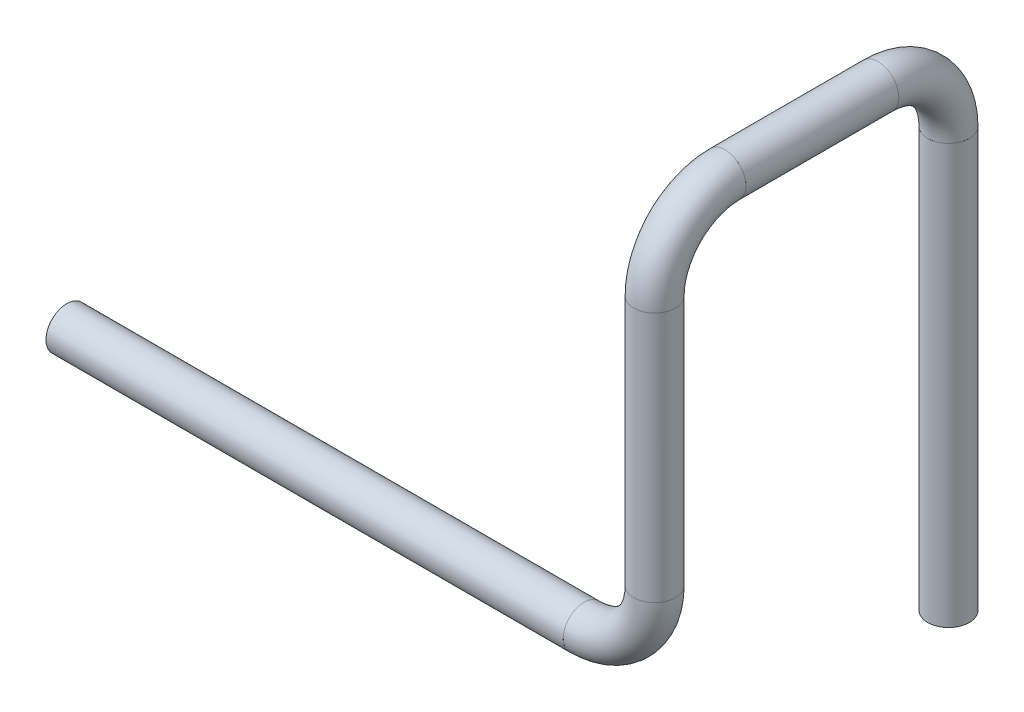
ISO-10303-21;
HEADER;
FILE_DESCRIPTION(('STEP AP214'),'2;1');
FILE_NAME('part.step','',(''),(''),'','','');
FILE_SCHEMA(('AUTOMOTIVE_DESIGN { 1 0 10303 214 1 1 1 1 }'));
ENDSEC;
DATA;
#1=APPLICATION_CONTEXT('core data for automotive mechanical design processes');
#2=APPLICATION_PROTOCOL_DEFINITION('international standard','automotive_design',2000,#1);
#3=PRODUCT_CONTEXT('',#1,'mechanical');
#4=PRODUCT('Part','Part','',(#3));
#5=PRODUCT_RELATED_PRODUCT_CATEGORY('part','',(#4));
#6=PRODUCT_DEFINITION_FORMATION('','',#4);
#7=PRODUCT_DEFINITION_CONTEXT('part definition',#1,'design');
#8=PRODUCT_DEFINITION('design','',#6,#7);
#9=PRODUCT_DEFINITION_SHAPE('','',#8);
#10=(LENGTH_UNIT() NAMED_UNIT(*) SI_UNIT(.MILLI.,.METRE.));
#11=(NAMED_UNIT(*) PLANE_ANGLE_UNIT() SI_UNIT($,.RADIAN.));
#12=(NAMED_UNIT(*) SI_UNIT($,.STERADIAN.) SOLID_ANGLE_UNIT());
#13=UNCERTAINTY_MEASURE_WITH_UNIT(LENGTH_MEASURE(1.E-05),#10,'distance_accuracy_value','');
#14=(GEOMETRIC_REPRESENTATION_CONTEXT(3) GLOBAL_UNCERTAINTY_ASSIGNED_CONTEXT((#13)) GLOBAL_UNIT_ASSIGNED_CONTEXT((#10,
#11,#12)) REPRESENTATION_CONTEXT('',''));
#15=CARTESIAN_POINT('',(0.,0.,0.));
#16=DIRECTION('',(0.,0.,1.));
#17=DIRECTION('',(1.,0.,0.));
#18=AXIS2_PLACEMENT_3D('',#15,#16,#17);
#19=CARTESIAN_POINT('',(264.,0.,0.));
#20=DIRECTION('',(-1.,0.,0.));
#21=DIRECTION('',(0.,0.,1.));
#22=AXIS2_PLACEMENT_3D('',#19,#20,#21);
#23=CYLINDRICAL_SURFACE('',#22,8.35);
#24=CARTESIAN_POINT('',(0.,0.,0.));
#25=DIRECTION('',(1.,0.,0.));
#26=DIRECTION('',(0.,0.,-1.));
#27=AXIS2_PLACEMENT_3D('',#24,#25,#26);
#28=CIRCLE('',#27,8.35);
#29=CARTESIAN_POINT('',(0.,0.,-8.35));
#30=VERTEX_POINT('',#29);
#31=EDGE_CURVE('E57',#30,#30,#28,.T.);
#32=ORIENTED_EDGE('',*,*,#31,.F.);
#33=EDGE_LOOP('',(#32));
#34=FACE_BOUND('',#33,.T.);
#35=CARTESIAN_POINT('',(264.,0.,0.));
#36=DIRECTION('',(1.,0.,0.));
#37=DIRECTION('',(0.,0.,-1.));
#38=AXIS2_PLACEMENT_3D('',#35,#36,#37);
#39=CIRCLE('',#38,8.35);
#40=CARTESIAN_POINT('',(264.,0.,-8.35));
#41=VERTEX_POINT('',#40);
#42=EDGE_CURVE('E53',#41,#41,#39,.T.);
#43=ORIENTED_EDGE('',*,*,#42,.T.);
#44=EDGE_LOOP('',(#43));
#45=FACE_BOUND('',#44,.T.);
#46=ADVANCED_FACE('F49',(#34,#45),#23,.F.);
#47=CARTESIAN_POINT('',(264.,0.,0.));
#48=DIRECTION('',(-1.,0.,0.));
#49=DIRECTION('',(0.,0.,1.));
#50=AXIS2_PLACEMENT_3D('',#47,#48,#49);
#51=CYLINDRICAL_SURFACE('',#50,10.65);
#52=CARTESIAN_POINT('',(0.,0.,0.));
#53=DIRECTION('',(1.,0.,0.));
#54=DIRECTION('',(0.,0.,-1.));
#55=AXIS2_PLACEMENT_3D('',#52,#53,#54);
#56=CIRCLE('',#55,10.65);
#57=CARTESIAN_POINT('',(0.,0.,-10.65));
#58=VERTEX_POINT('',#57);
#59=EDGE_CURVE('E61',#58,#58,#56,.T.);
#60=ORIENTED_EDGE('',*,*,#59,.T.);
#61=EDGE_LOOP('',(#60));
#62=FACE_BOUND('',#61,.T.);
#63=CARTESIAN_POINT('',(264.,0.,0.));
#64=DIRECTION('',(1.,0.,0.));
#65=DIRECTION('',(0.,0.,-1.));
#66=AXIS2_PLACEMENT_3D('',#63,#64,#65);
#67=CIRCLE('',#66,10.65);
#68=CARTESIAN_POINT('',(264.,0.,-10.65));
#69=VERTEX_POINT('',#68);
#70=EDGE_CURVE('E12',#69,#69,#67,.T.);
#71=ORIENTED_EDGE('',*,*,#70,.F.);
#72=EDGE_LOOP('',(#71));
#73=FACE_BOUND('',#72,.T.);
#74=ADVANCED_FACE('F76',(#62,#73),#51,.T.);
#75=CARTESIAN_POINT('',(0.,0.,0.));
#76=DIRECTION('',(1.,0.,0.));
#77=DIRECTION('',(0.,0.,-1.));
#78=AXIS2_PLACEMENT_3D('',#75,#76,#77);
#79=PLANE('',#78);
#80=ORIENTED_EDGE('',*,*,#31,.T.);
#81=EDGE_LOOP('',(#80));
#82=FACE_BOUND('',#81,.T.);
#83=ORIENTED_EDGE('',*,*,#59,.F.);
#84=EDGE_LOOP('',(#83));
#85=FACE_BOUND('',#84,.T.);
#86=ADVANCED_FACE('F72',(#82,#85),#79,.F.);
#87=CARTESIAN_POINT('',(264.,0.,0.));
#88=DIRECTION('',(1.,0.,0.));
#89=DIRECTION('',(0.,0.,-1.));
#90=AXIS2_PLACEMENT_3D('',#87,#88,#89);
#91=PLANE('',#90);
#92=ORIENTED_EDGE('',*,*,#42,.F.);
#93=EDGE_LOOP('',(#92));
#94=FACE_BOUND('',#93,.T.);
#95=ORIENTED_EDGE('',*,*,#70,.T.);
#96=EDGE_LOOP('',(#95));
#97=FACE_BOUND('',#96,.T.);
#98=ADVANCED_FACE('F51',(#94,#97),#91,.T.);
#99=CLOSED_SHELL('',(#46,#74,#86,#98));
#100=MANIFOLD_SOLID_BREP('B2',#99);
#101=CARTESIAN_POINT('',(264.,36.,0.));
#102=DIRECTION('',(0.,0.,-1.));
#103=DIRECTION('',(-1.,0.,0.));
#104=AXIS2_PLACEMENT_3D('',#101,#102,#103);
#105=TOROIDAL_SURFACE('',#104,35.9999999999999,8.35);
#106=CARTESIAN_POINT('',(300.,36.,0.));
#107=DIRECTION('',(0.,1.,0.));
#108=DIRECTION('',(-1.,0.,0.));
#109=AXIS2_PLACEMENT_3D('',#106,#107,#108);
#110=CIRCLE('',#109,8.35);
#111=CARTESIAN_POINT('',(308.35,36.,0.));
#112=VERTEX_POINT('',#111);
#113=EDGE_CURVE('E153',#112,#112,#110,.T.);
#114=CARTESIAN_POINT('',(264.,0.,0.));
#115=DIRECTION('',(-1.,0.,0.));
#116=DIRECTION('',(0.,0.,1.));
#117=AXIS2_PLACEMENT_3D('',#114,#115,#116);
#118=CIRCLE('',#117,8.35);
#119=CARTESIAN_POINT('',(264.,-8.34999999999991,0.));
#120=VERTEX_POINT('',#119);
#121=EDGE_CURVE('E143',#120,#120,#118,.T.);
#122=CARTESIAN_POINT('',(264.,36.,0.));
#123=DIRECTION('',(0.,0.,-1.));
#124=DIRECTION('',(-1.,0.,0.));
#125=AXIS2_PLACEMENT_3D('',#122,#123,#124);
#126=CIRCLE('',#125,44.3499999999999);
#127=EDGE_CURVE('',#112,#120,#126,.T.);
#128=ORIENTED_EDGE('',*,*,#113,.T.);
#129=ORIENTED_EDGE('',*,*,#121,.T.);
#130=ORIENTED_EDGE('',*,*,#127,.T.);
#131=ORIENTED_EDGE('',*,*,#127,.F.);
#132=EDGE_LOOP('',(#128,#130,#129,#131));
#133=FACE_BOUND('',#132,.T.);
#134=ADVANCED_FACE('F139',(#133),#105,.F.);
#135=CARTESIAN_POINT('',(264.,36.,0.));
#136=DIRECTION('',(0.,0.,-1.));
#137=DIRECTION('',(-1.,0.,0.));
#138=AXIS2_PLACEMENT_3D('',#135,#136,#137);
#139=TOROIDAL_SURFACE('',#138,35.9999999999999,10.65);
#140=CARTESIAN_POINT('',(300.,36.,0.));
#141=DIRECTION('',(0.,1.,0.));
#142=DIRECTION('',(-1.,0.,0.));
#143=AXIS2_PLACEMENT_3D('',#140,#141,#142);
#144=CIRCLE('',#143,10.65);
#145=CARTESIAN_POINT('',(310.65,36.,0.));
#146=VERTEX_POINT('',#145);
#147=EDGE_CURVE('E147',#146,#146,#144,.T.);
#148=CARTESIAN_POINT('',(264.,0.,0.));
#149=DIRECTION('',(-1.,0.,0.));
#150=DIRECTION('',(0.,0.,1.));
#151=AXIS2_PLACEMENT_3D('',#148,#149,#150);
#152=CIRCLE('',#151,10.65);
#153=CARTESIAN_POINT('',(264.,-10.6499999999999,0.));
#154=VERTEX_POINT('',#153);
#155=EDGE_CURVE('E48',#154,#154,#152,.T.);
#156=CARTESIAN_POINT('',(264.,36.,0.));
#157=DIRECTION('',(0.,0.,-1.));
#158=DIRECTION('',(-1.,0.,0.));
#159=AXIS2_PLACEMENT_3D('',#156,#157,#158);
#160=CIRCLE('',#159,46.6499999999999);
#161=EDGE_CURVE('',#146,#154,#160,.T.);
#162=ORIENTED_EDGE('',*,*,#147,.F.);
#163=ORIENTED_EDGE('',*,*,#155,.F.);
#164=ORIENTED_EDGE('',*,*,#161,.T.);
#165=ORIENTED_EDGE('',*,*,#161,.F.);
#166=EDGE_LOOP('',(#162,#164,#163,#165));
#167=FACE_BOUND('',#166,.T.);
#168=ADVANCED_FACE('F166',(#167),#139,.T.);
#169=CARTESIAN_POINT('',(300.,36.,0.));
#170=DIRECTION('',(0.,1.,0.));
#171=DIRECTION('',(-1.,0.,0.));
#172=AXIS2_PLACEMENT_3D('',#169,#170,#171);
#173=PLANE('',#172);
#174=ORIENTED_EDGE('',*,*,#113,.F.);
#175=EDGE_LOOP('',(#174));
#176=FACE_BOUND('',#175,.T.);
#177=ORIENTED_EDGE('',*,*,#147,.T.);
#178=EDGE_LOOP('',(#177));
#179=FACE_BOUND('',#178,.T.);
#180=ADVANCED_FACE('F162',(#176,#179),#173,.T.);
#181=CARTESIAN_POINT('',(264.,0.,0.));
#182=DIRECTION('',(-1.,0.,0.));
#183=DIRECTION('',(0.,0.,1.));
#184=AXIS2_PLACEMENT_3D('',#181,#182,#183);
#185=PLANE('',#184);
#186=ORIENTED_EDGE('',*,*,#121,.F.);
#187=EDGE_LOOP('',(#186));
#188=FACE_BOUND('',#187,.T.);
#189=ORIENTED_EDGE('',*,*,#155,.T.);
#190=EDGE_LOOP('',(#189));
#191=FACE_BOUND('',#190,.T.);
#192=ADVANCED_FACE('F141',(#188,#191),#185,.T.);
#193=CLOSED_SHELL('',(#134,#168,#180,#192));
#194=MANIFOLD_SOLID_BREP('B7',#193);
#195=CARTESIAN_POINT('',(300.,164.,0.));
#196=DIRECTION('',(0.,-1.,0.));
#197=DIRECTION('',(0.,0.,-1.));
#198=AXIS2_PLACEMENT_3D('',#195,#196,#197);
#199=CYLINDRICAL_SURFACE('',#198,8.35);
#200=CARTESIAN_POINT('',(300.,164.,0.));
#201=DIRECTION('',(0.,1.,0.));
#202=DIRECTION('',(-1.,0.,0.));
#203=AXIS2_PLACEMENT_3D('',#200,#201,#202);
#204=CIRCLE('',#203,8.35);
#205=CARTESIAN_POINT('',(291.65,164.,0.));
#206=VERTEX_POINT('',#205);
#207=EDGE_CURVE('E247',#206,#206,#204,.T.);
#208=ORIENTED_EDGE('',*,*,#207,.T.);
#209=EDGE_LOOP('',(#208));
#210=FACE_BOUND('',#209,.T.);
#211=CARTESIAN_POINT('',(300.,36.,0.));
#212=DIRECTION('',(0.,-1.,0.));
#213=DIRECTION('',(1.,0.,0.));
#214=AXIS2_PLACEMENT_3D('',#211,#212,#213);
#215=CIRCLE('',#214,8.35);
#216=CARTESIAN_POINT('',(308.35,36.,0.));
#217=VERTEX_POINT('',#216);
#218=EDGE_CURVE('E237',#217,#217,#215,.T.);
#219=ORIENTED_EDGE('',*,*,#218,.T.);
#220=EDGE_LOOP('',(#219));
#221=FACE_BOUND('',#220,.T.);
#222=ADVANCED_FACE('F233',(#210,#221),#199,.F.);
#223=CARTESIAN_POINT('',(300.,164.,0.));
#224=DIRECTION('',(0.,-1.,0.));
#225=DIRECTION('',(0.,0.,-1.));
#226=AXIS2_PLACEMENT_3D('',#223,#224,#225);
#227=CYLINDRICAL_SURFACE('',#226,10.65);
#228=CARTESIAN_POINT('',(300.,164.,0.));
#229=DIRECTION('',(0.,1.,0.));
#230=DIRECTION('',(-1.,0.,0.));
#231=AXIS2_PLACEMENT_3D('',#228,#229,#230);
#232=CIRCLE('',#231,10.65);
#233=CARTESIAN_POINT('',(289.35,164.,0.));
#234=VERTEX_POINT('',#233);
#235=EDGE_CURVE('E241',#234,#234,#232,.T.);
#236=ORIENTED_EDGE('',*,*,#235,.F.);
#237=EDGE_LOOP('',(#236));
#238=FACE_BOUND('',#237,.T.);
#239=CARTESIAN_POINT('',(300.,36.,0.));
#240=DIRECTION('',(0.,-1.,0.));
#241=DIRECTION('',(1.,0.,0.));
#242=AXIS2_PLACEMENT_3D('',#239,#240,#241);
#243=CIRCLE('',#242,10.65);
#244=CARTESIAN_POINT('',(310.65,36.,0.));
#245=VERTEX_POINT('',#244);
#246=EDGE_CURVE('E138',#245,#245,#243,.T.);
#247=ORIENTED_EDGE('',*,*,#246,.F.);
#248=EDGE_LOOP('',(#247));
#249=FACE_BOUND('',#248,.T.);
#250=ADVANCED_FACE('F260',(#238,#249),#227,.T.);
#251=CARTESIAN_POINT('',(300.,164.,0.));
#252=DIRECTION('',(0.,1.,0.));
#253=DIRECTION('',(-1.,0.,0.));
#254=AXIS2_PLACEMENT_3D('',#251,#252,#253);
#255=PLANE('',#254);
#256=ORIENTED_EDGE('',*,*,#207,.F.);
#257=EDGE_LOOP('',(#256));
#258=FACE_BOUND('',#257,.T.);
#259=ORIENTED_EDGE('',*,*,#235,.T.);
#260=EDGE_LOOP('',(#259));
#261=FACE_BOUND('',#260,.T.);
#262=ADVANCED_FACE('F256',(#258,#261),#255,.T.);
#263=CARTESIAN_POINT('',(300.,36.,0.));
#264=DIRECTION('',(0.,-1.,0.));
#265=DIRECTION('',(1.,0.,0.));
#266=AXIS2_PLACEMENT_3D('',#263,#264,#265);
#267=PLANE('',#266);
#268=ORIENTED_EDGE('',*,*,#218,.F.);
#269=EDGE_LOOP('',(#268));
#270=FACE_BOUND('',#269,.T.);
#271=ORIENTED_EDGE('',*,*,#246,.T.);
#272=EDGE_LOOP('',(#271));
#273=FACE_BOUND('',#272,.T.);
#274=ADVANCED_FACE('F235',(#270,#273),#267,.T.);
#275=CLOSED_SHELL('',(#222,#250,#262,#274));
#276=MANIFOLD_SOLID_BREP('B43',#275);
#277=CARTESIAN_POINT('',(300.,164.,-36.));
#278=DIRECTION('',(1.,0.,0.));
#279=DIRECTION('',(0.,0.,-1.));
#280=AXIS2_PLACEMENT_3D('',#277,#278,#279);
#281=TOROIDAL_SURFACE('',#280,36.,8.35);
#282=CARTESIAN_POINT('',(300.,200.,-36.));
#283=DIRECTION('',(0.,0.,-1.));
#284=DIRECTION('',(-1.,0.,0.));
#285=AXIS2_PLACEMENT_3D('',#282,#283,#284);
#286=CIRCLE('',#285,8.35);
#287=CARTESIAN_POINT('',(300.,208.35,-36.));
#288=VERTEX_POINT('',#287);
#289=EDGE_CURVE('E339',#288,#288,#286,.T.);
#290=CARTESIAN_POINT('',(300.,164.,0.));
#291=DIRECTION('',(0.,-1.,0.));
#292=DIRECTION('',(1.,0.,0.));
#293=AXIS2_PLACEMENT_3D('',#290,#291,#292);
#294=CIRCLE('',#293,8.35);
#295=CARTESIAN_POINT('',(300.,164.,8.34999999999997));
#296=VERTEX_POINT('',#295);
#297=EDGE_CURVE('E329',#296,#296,#294,.T.);
#298=CARTESIAN_POINT('',(300.,164.,-36.));
#299=DIRECTION('',(1.,0.,0.));
#300=DIRECTION('',(0.,0.,-1.));
#301=AXIS2_PLACEMENT_3D('',#298,#299,#300);
#302=CIRCLE('',#301,44.35);
#303=EDGE_CURVE('',#288,#296,#302,.T.);
#304=ORIENTED_EDGE('',*,*,#289,.T.);
#305=ORIENTED_EDGE('',*,*,#297,.T.);
#306=ORIENTED_EDGE('',*,*,#303,.T.);
#307=ORIENTED_EDGE('',*,*,#303,.F.);
#308=EDGE_LOOP('',(#304,#306,#305,#307));
#309=FACE_BOUND('',#308,.T.);
#310=ADVANCED_FACE('F325',(#309),#281,.F.);
#311=CARTESIAN_POINT('',(300.,164.,-36.));
#312=DIRECTION('',(1.,0.,0.));
#313=DIRECTION('',(0.,0.,-1.));
#314=AXIS2_PLACEMENT_3D('',#311,#312,#313);
#315=TOROIDAL_SURFACE('',#314,36.,10.65);
#316=CARTESIAN_POINT('',(300.,200.,-36.));
#317=DIRECTION('',(0.,0.,-1.));
#318=DIRECTION('',(-1.,0.,0.));
#319=AXIS2_PLACEMENT_3D('',#316,#317,#318);
#320=CIRCLE('',#319,10.65);
#321=CARTESIAN_POINT('',(300.,210.65,-36.));
#322=VERTEX_POINT('',#321);
#323=EDGE_CURVE('E333',#322,#322,#320,.T.);
#324=CARTESIAN_POINT('',(300.,164.,0.));
#325=DIRECTION('',(0.,-1.,0.));
#326=DIRECTION('',(1.,0.,0.));
#327=AXIS2_PLACEMENT_3D('',#324,#325,#326);
#328=CIRCLE('',#327,10.65);
#329=CARTESIAN_POINT('',(300.,164.,10.65));
#330=VERTEX_POINT('',#329);
#331=EDGE_CURVE('E232',#330,#330,#328,.T.);
#332=CARTESIAN_POINT('',(300.,164.,-36.));
#333=DIRECTION('',(1.,0.,0.));
#334=DIRECTION('',(0.,0.,-1.));
#335=AXIS2_PLACEMENT_3D('',#332,#333,#334);
#336=CIRCLE('',#335,46.65);
#337=EDGE_CURVE('',#322,#330,#336,.T.);
#338=ORIENTED_EDGE('',*,*,#323,.F.);
#339=ORIENTED_EDGE('',*,*,#331,.F.);
#340=ORIENTED_EDGE('',*,*,#337,.T.);
#341=ORIENTED_EDGE('',*,*,#337,.F.);
#342=EDGE_LOOP('',(#338,#340,#339,#341));
#343=FACE_BOUND('',#342,.T.);
#344=ADVANCED_FACE('F352',(#343),#315,.T.);
#345=CARTESIAN_POINT('',(300.,200.,-36.));
#346=DIRECTION('',(0.,0.,-1.));
#347=DIRECTION('',(-1.,0.,0.));
#348=AXIS2_PLACEMENT_3D('',#345,#346,#347);
#349=PLANE('',#348);
#350=ORIENTED_EDGE('',*,*,#289,.F.);
#351=EDGE_LOOP('',(#350));
#352=FACE_BOUND('',#351,.T.);
#353=ORIENTED_EDGE('',*,*,#323,.T.);
#354=EDGE_LOOP('',(#353));
#355=FACE_BOUND('',#354,.T.);
#356=ADVANCED_FACE('F348',(#352,#355),#349,.T.);
#357=CARTESIAN_POINT('',(300.,164.,0.));
#358=DIRECTION('',(0.,-1.,0.));
#359=DIRECTION('',(1.,0.,0.));
#360=AXIS2_PLACEMENT_3D('',#357,#358,#359);
#361=PLANE('',#360);
#362=ORIENTED_EDGE('',*,*,#297,.F.);
#363=EDGE_LOOP('',(#362));
#364=FACE_BOUND('',#363,.T.);
#365=ORIENTED_EDGE('',*,*,#331,.T.);
#366=EDGE_LOOP('',(#365));
#367=FACE_BOUND('',#366,.T.);
#368=ADVANCED_FACE('F327',(#364,#367),#361,.T.);
#369=CLOSED_SHELL('',(#310,#344,#356,#368));
#370=MANIFOLD_SOLID_BREP('B133',#369);
#371=CARTESIAN_POINT('',(300.,200.,-114.));
#372=DIRECTION('',(0.,0.,1.));
#373=DIRECTION('',(1.,0.,0.));
#374=AXIS2_PLACEMENT_3D('',#371,#372,#373);
#375=CYLINDRICAL_SURFACE('',#374,8.35);
#376=CARTESIAN_POINT('',(300.,200.,-114.));
#377=DIRECTION('',(0.,0.,-1.));
#378=DIRECTION('',(-1.,0.,0.));
#379=AXIS2_PLACEMENT_3D('',#376,#377,#378);
#380=CIRCLE('',#379,8.35);
#381=CARTESIAN_POINT('',(291.65,200.,-114.));
#382=VERTEX_POINT('',#381);
#383=EDGE_CURVE('E433',#382,#382,#380,.T.);
#384=ORIENTED_EDGE('',*,*,#383,.T.);
#385=EDGE_LOOP('',(#384));
#386=FACE_BOUND('',#385,.T.);
#387=CARTESIAN_POINT('',(300.,200.,-36.));
#388=DIRECTION('',(0.,0.,1.));
#389=DIRECTION('',(1.,0.,0.));
#390=AXIS2_PLACEMENT_3D('',#387,#388,#389);
#391=CIRCLE('',#390,8.35);
#392=CARTESIAN_POINT('',(308.35,200.,-36.));
#393=VERTEX_POINT('',#392);
#394=EDGE_CURVE('E423',#393,#393,#391,.T.);
#395=ORIENTED_EDGE('',*,*,#394,.T.);
#396=EDGE_LOOP('',(#395));
#397=FACE_BOUND('',#396,.T.);
#398=ADVANCED_FACE('F419',(#386,#397),#375,.F.);
#399=CARTESIAN_POINT('',(300.,200.,-114.));
#400=DIRECTION('',(0.,0.,1.));
#401=DIRECTION('',(1.,0.,0.));
#402=AXIS2_PLACEMENT_3D('',#399,#400,#401);
#403=CYLINDRICAL_SURFACE('',#402,10.65);
#404=CARTESIAN_POINT('',(300.,200.,-114.));
#405=DIRECTION('',(0.,0.,-1.));
#406=DIRECTION('',(-1.,0.,0.));
#407=AXIS2_PLACEMENT_3D('',#404,#405,#406);
#408=CIRCLE('',#407,10.65);
#409=CARTESIAN_POINT('',(289.35,200.,-114.));
#410=VERTEX_POINT('',#409);
#411=EDGE_CURVE('E427',#410,#410,#408,.T.);
#412=ORIENTED_EDGE('',*,*,#411,.F.);
#413=EDGE_LOOP('',(#412));
#414=FACE_BOUND('',#413,.T.);
#415=CARTESIAN_POINT('',(300.,200.,-36.));
#416=DIRECTION('',(0.,0.,1.));
#417=DIRECTION('',(1.,0.,0.));
#418=AXIS2_PLACEMENT_3D('',#415,#416,#417);
#419=CIRCLE('',#418,10.65);
#420=CARTESIAN_POINT('',(310.65,200.,-36.));
#421=VERTEX_POINT('',#420);
#422=EDGE_CURVE('E324',#421,#421,#419,.T.);
#423=ORIENTED_EDGE('',*,*,#422,.F.);
#424=EDGE_LOOP('',(#423));
#425=FACE_BOUND('',#424,.T.);
#426=ADVANCED_FACE('F446',(#414,#425),#403,.T.);
#427=CARTESIAN_POINT('',(300.,200.,-114.));
#428=DIRECTION('',(0.,0.,-1.));
#429=DIRECTION('',(-1.,0.,0.));
#430=AXIS2_PLACEMENT_3D('',#427,#428,#429);
#431=PLANE('',#430);
#432=ORIENTED_EDGE('',*,*,#383,.F.);
#433=EDGE_LOOP('',(#432));
#434=FACE_BOUND('',#433,.T.);
#435=ORIENTED_EDGE('',*,*,#411,.T.);
#436=EDGE_LOOP('',(#435));
#437=FACE_BOUND('',#436,.T.);
#438=ADVANCED_FACE('F442',(#434,#437),#431,.T.);
#439=CARTESIAN_POINT('',(300.,200.,-36.));
#440=DIRECTION('',(0.,0.,1.));
#441=DIRECTION('',(1.,0.,0.));
#442=AXIS2_PLACEMENT_3D('',#439,#440,#441);
#443=PLANE('',#442);
#444=ORIENTED_EDGE('',*,*,#394,.F.);
#445=EDGE_LOOP('',(#444));
#446=FACE_BOUND('',#445,.T.);
#447=ORIENTED_EDGE('',*,*,#422,.T.);
#448=EDGE_LOOP('',(#447));
#449=FACE_BOUND('',#448,.T.);
#450=ADVANCED_FACE('F421',(#446,#449),#443,.T.);
#451=CLOSED_SHELL('',(#398,#426,#438,#450));
#452=MANIFOLD_SOLID_BREP('B227',#451);
#453=CARTESIAN_POINT('',(300.,164.,-114.));
#454=DIRECTION('',(1.,0.,0.));
#455=DIRECTION('',(0.,0.,-1.));
#456=AXIS2_PLACEMENT_3D('',#453,#454,#455);
#457=TOROIDAL_SURFACE('',#456,36.,8.35);
#458=CARTESIAN_POINT('',(300.,164.,-150.));
#459=DIRECTION('',(0.,-1.,0.));
#460=DIRECTION('',(0.,0.,-1.));
#461=AXIS2_PLACEMENT_3D('',#458,#459,#460);
#462=CIRCLE('',#461,8.35);
#463=CARTESIAN_POINT('',(300.,164.,-158.35));
#464=VERTEX_POINT('',#463);
#465=EDGE_CURVE('E524',#464,#464,#462,.T.);
#466=CARTESIAN_POINT('',(300.,200.,-114.));
#467=DIRECTION('',(0.,0.,1.));
#468=DIRECTION('',(1.,0.,0.));
#469=AXIS2_PLACEMENT_3D('',#466,#467,#468);
#470=CIRCLE('',#469,8.35);
#471=CARTESIAN_POINT('',(300.,208.35,-114.));
#472=VERTEX_POINT('',#471);
#473=EDGE_CURVE('E514',#472,#472,#470,.T.);
#474=CARTESIAN_POINT('',(300.,164.,-114.));
#475=DIRECTION('',(1.,0.,0.));
#476=DIRECTION('',(0.,0.,-1.));
#477=AXIS2_PLACEMENT_3D('',#474,#475,#476);
#478=CIRCLE('',#477,44.35);
#479=EDGE_CURVE('',#464,#472,#478,.T.);
#480=ORIENTED_EDGE('',*,*,#465,.T.);
#481=ORIENTED_EDGE('',*,*,#473,.T.);
#482=ORIENTED_EDGE('',*,*,#479,.T.);
#483=ORIENTED_EDGE('',*,*,#479,.F.);
#484=EDGE_LOOP('',(#480,#482,#481,#483));
#485=FACE_BOUND('',#484,.T.);
#486=ADVANCED_FACE('F510',(#485),#457,.F.);
#487=CARTESIAN_POINT('',(300.,164.,-114.));
#488=DIRECTION('',(1.,0.,0.));
#489=DIRECTION('',(0.,0.,-1.));
#490=AXIS2_PLACEMENT_3D('',#487,#488,#489);
#491=TOROIDAL_SURFACE('',#490,36.,10.65);
#492=CARTESIAN_POINT('',(300.,164.,-150.));
#493=DIRECTION('',(0.,-1.,0.));
#494=DIRECTION('',(0.,0.,-1.));
#495=AXIS2_PLACEMENT_3D('',#492,#493,#494);
#496=CIRCLE('',#495,10.65);
#497=CARTESIAN_POINT('',(300.,164.,-160.65));
#498=VERTEX_POINT('',#497);
#499=EDGE_CURVE('E518',#498,#498,#496,.T.);
#500=CARTESIAN_POINT('',(300.,200.,-114.));
#501=DIRECTION('',(0.,0.,1.));
#502=DIRECTION('',(1.,0.,0.));
#503=AXIS2_PLACEMENT_3D('',#500,#501,#502);
#504=CIRCLE('',#503,10.65);
#505=CARTESIAN_POINT('',(300.,210.65,-114.));
#506=VERTEX_POINT('',#505);
#507=EDGE_CURVE('E418',#506,#506,#504,.T.);
#508=CARTESIAN_POINT('',(300.,164.,-114.));
#509=DIRECTION('',(1.,0.,0.));
#510=DIRECTION('',(0.,0.,-1.));
#511=AXIS2_PLACEMENT_3D('',#508,#509,#510);
#512=CIRCLE('',#511,46.65);
#513=EDGE_CURVE('',#498,#506,#512,.T.);
#514=ORIENTED_EDGE('',*,*,#499,.F.);
#515=ORIENTED_EDGE('',*,*,#507,.F.);
#516=ORIENTED_EDGE('',*,*,#513,.T.);
#517=ORIENTED_EDGE('',*,*,#513,.F.);
#518=EDGE_LOOP('',(#514,#516,#515,#517));
#519=FACE_BOUND('',#518,.T.);
#520=ADVANCED_FACE('F537',(#519),#491,.T.);
#521=CARTESIAN_POINT('',(300.,164.,-150.));
#522=DIRECTION('',(0.,-1.,0.));
#523=DIRECTION('',(0.,0.,-1.));
#524=AXIS2_PLACEMENT_3D('',#521,#522,#523);
#525=PLANE('',#524);
#526=ORIENTED_EDGE('',*,*,#465,.F.);
#527=EDGE_LOOP('',(#526));
#528=FACE_BOUND('',#527,.T.);
#529=ORIENTED_EDGE('',*,*,#499,.T.);
#530=EDGE_LOOP('',(#529));
#531=FACE_BOUND('',#530,.T.);
#532=ADVANCED_FACE('F533',(#528,#531),#525,.T.);
#533=CARTESIAN_POINT('',(300.,200.,-114.));
#534=DIRECTION('',(0.,0.,1.));
#535=DIRECTION('',(1.,0.,0.));
#536=AXIS2_PLACEMENT_3D('',#533,#534,#535);
#537=PLANE('',#536);
#538=ORIENTED_EDGE('',*,*,#473,.F.);
#539=EDGE_LOOP('',(#538));
#540=FACE_BOUND('',#539,.T.);
#541=ORIENTED_EDGE('',*,*,#507,.T.);
#542=EDGE_LOOP('',(#541));
#543=FACE_BOUND('',#542,.T.);
#544=ADVANCED_FACE('F512',(#540,#543),#537,.T.);
#545=CLOSED_SHELL('',(#486,#520,#532,#544));
#546=MANIFOLD_SOLID_BREP('B319',#545);
#547=CARTESIAN_POINT('',(300.,-50.,-150.));
#548=DIRECTION('',(0.,1.,0.));
#549=DIRECTION('',(0.,0.,1.));
#550=AXIS2_PLACEMENT_3D('',#547,#548,#549);
#551=CYLINDRICAL_SURFACE('',#550,8.35);
#552=CARTESIAN_POINT('',(300.,-50.,-150.));
#553=DIRECTION('',(0.,-1.,0.));
#554=DIRECTION('',(0.,0.,1.));
#555=AXIS2_PLACEMENT_3D('',#552,#553,#554);
#556=CIRCLE('',#555,8.35);
#557=CARTESIAN_POINT('',(300.,-50.,-141.65));
#558=VERTEX_POINT('',#557);
#559=EDGE_CURVE('E610',#558,#558,#556,.T.);
#560=ORIENTED_EDGE('',*,*,#559,.T.);
#561=EDGE_LOOP('',(#560));
#562=FACE_BOUND('',#561,.T.);
#563=CARTESIAN_POINT('',(300.,164.,-150.));
#564=DIRECTION('',(0.,1.,0.));
#565=DIRECTION('',(0.,0.,1.));
#566=AXIS2_PLACEMENT_3D('',#563,#564,#565);
#567=CIRCLE('',#566,8.35);
#568=CARTESIAN_POINT('',(300.,164.,-141.65));
#569=VERTEX_POINT('',#568);
#570=EDGE_CURVE('E600',#569,#569,#567,.T.);
#571=ORIENTED_EDGE('',*,*,#570,.T.);
#572=EDGE_LOOP('',(#571));
#573=FACE_BOUND('',#572,.T.);
#574=ADVANCED_FACE('F596',(#562,#573),#551,.F.);
#575=CARTESIAN_POINT('',(300.,-50.,-150.));
#576=DIRECTION('',(0.,1.,0.));
#577=DIRECTION('',(0.,0.,1.));
#578=AXIS2_PLACEMENT_3D('',#575,#576,#577);
#579=CYLINDRICAL_SURFACE('',#578,10.65);
#580=CARTESIAN_POINT('',(300.,-50.,-150.));
#581=DIRECTION('',(0.,-1.,0.));
#582=DIRECTION('',(0.,0.,1.));
#583=AXIS2_PLACEMENT_3D('',#580,#581,#582);
#584=CIRCLE('',#583,10.65);
#585=CARTESIAN_POINT('',(300.,-50.,-139.35));
#586=VERTEX_POINT('',#585);
#587=EDGE_CURVE('E604',#586,#586,#584,.T.);
#588=ORIENTED_EDGE('',*,*,#587,.F.);
#589=EDGE_LOOP('',(#588));
#590=FACE_BOUND('',#589,.T.);
#591=CARTESIAN_POINT('',(300.,164.,-150.));
#592=DIRECTION('',(0.,1.,0.));
#593=DIRECTION('',(0.,0.,1.));
#594=AXIS2_PLACEMENT_3D('',#591,#592,#593);
#595=CIRCLE('',#594,10.65);
#596=CARTESIAN_POINT('',(300.,164.,-139.35));
#597=VERTEX_POINT('',#596);
#598=EDGE_CURVE('E509',#597,#597,#595,.T.);
#599=ORIENTED_EDGE('',*,*,#598,.F.);
#600=EDGE_LOOP('',(#599));
#601=FACE_BOUND('',#600,.T.);
#602=ADVANCED_FACE('F623',(#590,#601),#579,.T.);
#603=CARTESIAN_POINT('',(300.,-50.,-150.));
#604=DIRECTION('',(0.,-1.,0.));
#605=DIRECTION('',(0.,0.,1.));
#606=AXIS2_PLACEMENT_3D('',#603,#604,#605);
#607=PLANE('',#606);
#608=ORIENTED_EDGE('',*,*,#559,.F.);
#609=EDGE_LOOP('',(#608));
#610=FACE_BOUND('',#609,.T.);
#611=ORIENTED_EDGE('',*,*,#587,.T.);
#612=EDGE_LOOP('',(#611));
#613=FACE_BOUND('',#612,.T.);
#614=ADVANCED_FACE('F619',(#610,#613),#607,.T.);
#615=CARTESIAN_POINT('',(300.,164.,-150.));
#616=DIRECTION('',(0.,1.,0.));
#617=DIRECTION('',(0.,0.,1.));
#618=AXIS2_PLACEMENT_3D('',#615,#616,#617);
#619=PLANE('',#618);
#620=ORIENTED_EDGE('',*,*,#570,.F.);
#621=EDGE_LOOP('',(#620));
#622=FACE_BOUND('',#621,.T.);
#623=ORIENTED_EDGE('',*,*,#598,.T.);
#624=EDGE_LOOP('',(#623));
#625=FACE_BOUND('',#624,.T.);
#626=ADVANCED_FACE('F598',(#622,#625),#619,.T.);
#627=CLOSED_SHELL('',(#574,#602,#614,#626));
#628=MANIFOLD_SOLID_BREP('B413',#627);
#629=ADVANCED_BREP_SHAPE_REPRESENTATION('',(#18,#100,#194,#276,#370,#452,#546,#628),#14);
#630=SHAPE_DEFINITION_REPRESENTATION(#9,#629);
ENDSEC;
END-ISO-10303-21;
